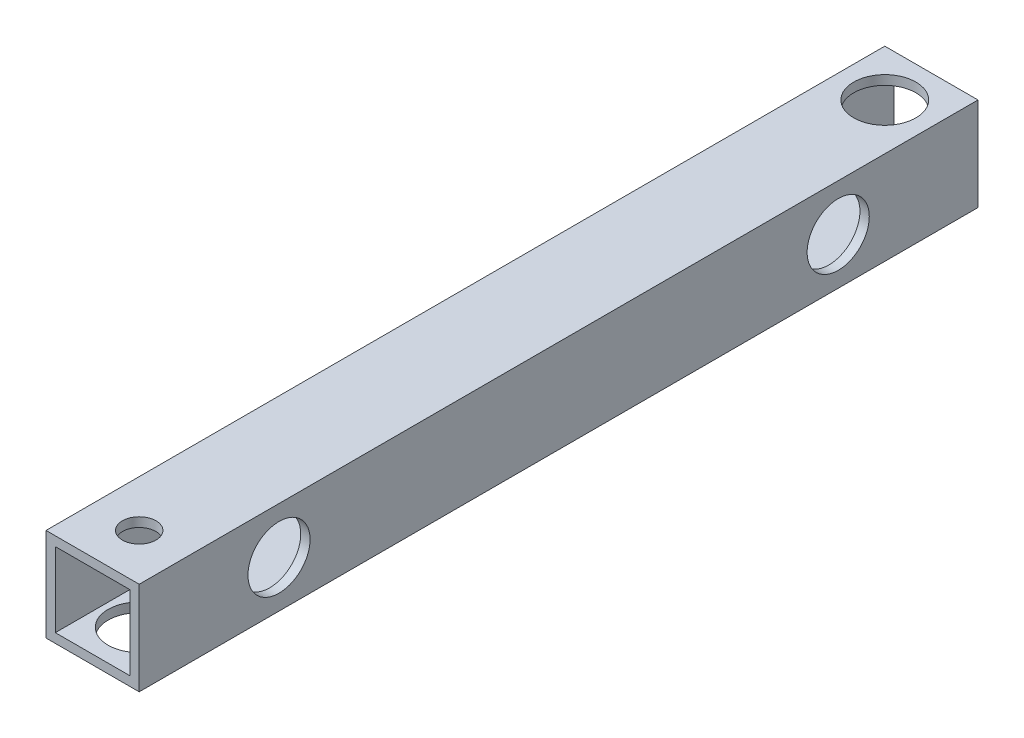
ISO-10303-21;
HEADER;
FILE_DESCRIPTION(('STEP AP214'),'2;1');
FILE_NAME('part.step','',(''),(''),'','','');
FILE_SCHEMA(('AUTOMOTIVE_DESIGN { 1 0 10303 214 1 1 1 1 }'));
ENDSEC;
DATA;
#1=APPLICATION_CONTEXT('core data for automotive mechanical design processes');
#2=APPLICATION_PROTOCOL_DEFINITION('international standard','automotive_design',2000,#1);
#3=PRODUCT_CONTEXT('',#1,'mechanical');
#4=PRODUCT('Part','Part','',(#3));
#5=PRODUCT_RELATED_PRODUCT_CATEGORY('part','',(#4));
#6=PRODUCT_DEFINITION_FORMATION('','',#4);
#7=PRODUCT_DEFINITION_CONTEXT('part definition',#1,'design');
#8=PRODUCT_DEFINITION('design','',#6,#7);
#9=PRODUCT_DEFINITION_SHAPE('','',#8);
#10=(LENGTH_UNIT() NAMED_UNIT(*) SI_UNIT(.MILLI.,.METRE.));
#11=(NAMED_UNIT(*) PLANE_ANGLE_UNIT() SI_UNIT($,.RADIAN.));
#12=(NAMED_UNIT(*) SI_UNIT($,.STERADIAN.) SOLID_ANGLE_UNIT());
#13=UNCERTAINTY_MEASURE_WITH_UNIT(LENGTH_MEASURE(1.E-05),#10,'distance_accuracy_value','');
#14=(GEOMETRIC_REPRESENTATION_CONTEXT(3) GLOBAL_UNCERTAINTY_ASSIGNED_CONTEXT((#13)) GLOBAL_UNIT_ASSIGNED_CONTEXT((#10,
#11,#12)) REPRESENTATION_CONTEXT('',''));
#15=CARTESIAN_POINT('',(0.,0.,0.));
#16=DIRECTION('',(0.,0.,1.));
#17=DIRECTION('',(1.,0.,0.));
#18=AXIS2_PLACEMENT_3D('',#15,#16,#17);
#19=CARTESIAN_POINT('',(0.,0.,135.));
#20=DIRECTION('',(0.,0.,-1.));
#21=DIRECTION('',(-1.,0.,0.));
#22=AXIS2_PLACEMENT_3D('',#19,#20,#21);
#23=PLANE('',#22);
#24=DIRECTION('',(0.,1.,0.));
#25=VECTOR('',#24,1.);
#26=CARTESIAN_POINT('',(7.5,-7.5,135.));
#27=LINE('',#26,#25);
#28=CARTESIAN_POINT('',(7.5,-7.5,135.));
#29=VERTEX_POINT('',#28);
#30=CARTESIAN_POINT('',(7.5,7.5,135.));
#31=VERTEX_POINT('',#30);
#32=EDGE_CURVE('E146',#29,#31,#27,.T.);
#33=ORIENTED_EDGE('',*,*,#32,.T.);
#34=DIRECTION('',(-1.,0.,0.));
#35=VECTOR('',#34,1.);
#36=CARTESIAN_POINT('',(-7.5,7.5,135.));
#37=LINE('',#36,#35);
#38=CARTESIAN_POINT('',(-7.5,7.5,135.));
#39=VERTEX_POINT('',#38);
#40=EDGE_CURVE('E149',#31,#39,#37,.T.);
#41=ORIENTED_EDGE('',*,*,#40,.T.);
#42=DIRECTION('',(0.,-1.,0.));
#43=VECTOR('',#42,1.);
#44=CARTESIAN_POINT('',(-7.5,-7.5,135.));
#45=LINE('',#44,#43);
#46=CARTESIAN_POINT('',(-7.5,-7.5,135.));
#47=VERTEX_POINT('',#46);
#48=EDGE_CURVE('E152',#39,#47,#45,.T.);
#49=ORIENTED_EDGE('',*,*,#48,.T.);
#50=DIRECTION('',(1.,0.,0.));
#51=VECTOR('',#50,1.);
#52=CARTESIAN_POINT('',(-7.5,-7.5,135.));
#53=LINE('',#52,#51);
#54=EDGE_CURVE('E154',#47,#29,#53,.T.);
#55=ORIENTED_EDGE('',*,*,#54,.T.);
#56=EDGE_LOOP('',(#33,#41,#49,#55));
#57=FACE_BOUND('',#56,.T.);
#58=DIRECTION('',(0.,1.,0.));
#59=VECTOR('',#58,1.);
#60=CARTESIAN_POINT('',(6.,-6.,135.));
#61=LINE('',#60,#59);
#62=CARTESIAN_POINT('',(6.,-6.,135.));
#63=VERTEX_POINT('',#62);
#64=CARTESIAN_POINT('',(6.,6.,135.));
#65=VERTEX_POINT('',#64);
#66=EDGE_CURVE('E108',#63,#65,#61,.T.);
#67=ORIENTED_EDGE('',*,*,#66,.F.);
#68=DIRECTION('',(1.,0.,0.));
#69=VECTOR('',#68,1.);
#70=CARTESIAN_POINT('',(-6.,-6.,135.));
#71=LINE('',#70,#69);
#72=CARTESIAN_POINT('',(-6.,-6.,135.));
#73=VERTEX_POINT('',#72);
#74=EDGE_CURVE('E130',#73,#63,#71,.T.);
#75=ORIENTED_EDGE('',*,*,#74,.F.);
#76=DIRECTION('',(0.,-1.,0.));
#77=VECTOR('',#76,1.);
#78=CARTESIAN_POINT('',(-6.,-6.,135.));
#79=LINE('',#78,#77);
#80=CARTESIAN_POINT('',(-6.,6.,135.));
#81=VERTEX_POINT('',#80);
#82=EDGE_CURVE('E128',#81,#73,#79,.T.);
#83=ORIENTED_EDGE('',*,*,#82,.F.);
#84=DIRECTION('',(-1.,0.,0.));
#85=VECTOR('',#84,1.);
#86=CARTESIAN_POINT('',(-6.,6.,135.));
#87=LINE('',#86,#85);
#88=EDGE_CURVE('E116',#65,#81,#87,.T.);
#89=ORIENTED_EDGE('',*,*,#88,.F.);
#90=EDGE_LOOP('',(#67,#75,#83,#89));
#91=FACE_BOUND('',#90,.T.);
#92=ADVANCED_FACE('F41',(#57,#91),#23,.F.);
#93=CARTESIAN_POINT('',(0.,0.,0.));
#94=DIRECTION('',(0.,0.,-1.));
#95=DIRECTION('',(-1.,0.,0.));
#96=AXIS2_PLACEMENT_3D('',#93,#94,#95);
#97=PLANE('',#96);
#98=DIRECTION('',(0.,1.,0.));
#99=VECTOR('',#98,1.);
#100=CARTESIAN_POINT('',(7.5,-7.5,0.));
#101=LINE('',#100,#99);
#102=CARTESIAN_POINT('',(7.5,-7.5,0.));
#103=VERTEX_POINT('',#102);
#104=CARTESIAN_POINT('',(7.5,7.5,0.));
#105=VERTEX_POINT('',#104);
#106=EDGE_CURVE('E124',#103,#105,#101,.T.);
#107=ORIENTED_EDGE('',*,*,#106,.F.);
#108=DIRECTION('',(1.,0.,0.));
#109=VECTOR('',#108,1.);
#110=CARTESIAN_POINT('',(-7.5,-7.5,0.));
#111=LINE('',#110,#109);
#112=CARTESIAN_POINT('',(-7.5,-7.5,0.));
#113=VERTEX_POINT('',#112);
#114=EDGE_CURVE('E150',#113,#103,#111,.T.);
#115=ORIENTED_EDGE('',*,*,#114,.F.);
#116=DIRECTION('',(0.,-1.,0.));
#117=VECTOR('',#116,1.);
#118=CARTESIAN_POINT('',(-7.5,-7.5,0.));
#119=LINE('',#118,#117);
#120=CARTESIAN_POINT('',(-7.5,7.5,0.));
#121=VERTEX_POINT('',#120);
#122=EDGE_CURVE('E161',#121,#113,#119,.T.);
#123=ORIENTED_EDGE('',*,*,#122,.F.);
#124=DIRECTION('',(-1.,0.,0.));
#125=VECTOR('',#124,1.);
#126=CARTESIAN_POINT('',(-7.5,7.5,0.));
#127=LINE('',#126,#125);
#128=EDGE_CURVE('E159',#105,#121,#127,.T.);
#129=ORIENTED_EDGE('',*,*,#128,.F.);
#130=EDGE_LOOP('',(#107,#115,#123,#129));
#131=FACE_BOUND('',#130,.T.);
#132=DIRECTION('',(1.,0.,0.));
#133=VECTOR('',#132,1.);
#134=CARTESIAN_POINT('',(-6.,-6.,0.));
#135=LINE('',#134,#133);
#136=CARTESIAN_POINT('',(-6.,-6.,0.));
#137=VERTEX_POINT('',#136);
#138=CARTESIAN_POINT('',(6.,-6.,0.));
#139=VERTEX_POINT('',#138);
#140=EDGE_CURVE('E117',#137,#139,#135,.T.);
#141=ORIENTED_EDGE('',*,*,#140,.T.);
#142=DIRECTION('',(0.,1.,0.));
#143=VECTOR('',#142,1.);
#144=CARTESIAN_POINT('',(6.,-6.,0.));
#145=LINE('',#144,#143);
#146=CARTESIAN_POINT('',(6.,6.,0.));
#147=VERTEX_POINT('',#146);
#148=EDGE_CURVE('E66',#139,#147,#145,.T.);
#149=ORIENTED_EDGE('',*,*,#148,.T.);
#150=DIRECTION('',(-1.,0.,0.));
#151=VECTOR('',#150,1.);
#152=CARTESIAN_POINT('',(-6.,6.,0.));
#153=LINE('',#152,#151);
#154=CARTESIAN_POINT('',(-6.,6.,0.));
#155=VERTEX_POINT('',#154);
#156=EDGE_CURVE('E123',#147,#155,#153,.T.);
#157=ORIENTED_EDGE('',*,*,#156,.T.);
#158=DIRECTION('',(0.,-1.,0.));
#159=VECTOR('',#158,1.);
#160=CARTESIAN_POINT('',(-6.,-6.,0.));
#161=LINE('',#160,#159);
#162=EDGE_CURVE('E138',#155,#137,#161,.T.);
#163=ORIENTED_EDGE('',*,*,#162,.T.);
#164=EDGE_LOOP('',(#141,#149,#157,#163));
#165=FACE_BOUND('',#164,.T.);
#166=ADVANCED_FACE('F234',(#131,#165),#97,.T.);
#167=CARTESIAN_POINT('',(7.5,-7.5,135.));
#168=DIRECTION('',(-1.,0.,0.));
#169=DIRECTION('',(0.,0.,1.));
#170=AXIS2_PLACEMENT_3D('',#167,#168,#169);
#171=PLANE('',#170);
#172=CARTESIAN_POINT('',(7.5,0.,22.5));
#173=DIRECTION('',(1.,0.,0.));
#174=DIRECTION('',(0.,0.,-1.));
#175=AXIS2_PLACEMENT_3D('',#172,#173,#174);
#176=CIRCLE('',#175,5.);
#177=CARTESIAN_POINT('',(7.5,0.,17.5));
#178=VERTEX_POINT('',#177);
#179=EDGE_CURVE('E191',#178,#178,#176,.T.);
#180=ORIENTED_EDGE('',*,*,#179,.F.);
#181=EDGE_LOOP('',(#180));
#182=FACE_BOUND('',#181,.T.);
#183=CARTESIAN_POINT('',(7.5,0.,112.5));
#184=DIRECTION('',(1.,0.,0.));
#185=DIRECTION('',(0.,0.,-1.));
#186=AXIS2_PLACEMENT_3D('',#183,#184,#185);
#187=CIRCLE('',#186,5.);
#188=CARTESIAN_POINT('',(7.5,0.,107.5));
#189=VERTEX_POINT('',#188);
#190=EDGE_CURVE('E201',#189,#189,#187,.T.);
#191=ORIENTED_EDGE('',*,*,#190,.F.);
#192=EDGE_LOOP('',(#191));
#193=FACE_BOUND('',#192,.T.);
#194=ORIENTED_EDGE('',*,*,#106,.T.);
#195=DIRECTION('',(0.,0.,-1.));
#196=VECTOR('',#195,1.);
#197=CARTESIAN_POINT('',(7.5,7.5,135.));
#198=LINE('',#197,#196);
#199=EDGE_CURVE('E11',#31,#105,#198,.T.);
#200=ORIENTED_EDGE('',*,*,#199,.F.);
#201=ORIENTED_EDGE('',*,*,#32,.F.);
#202=DIRECTION('',(0.,0.,-1.));
#203=VECTOR('',#202,1.);
#204=CARTESIAN_POINT('',(7.5,-7.5,135.));
#205=LINE('',#204,#203);
#206=EDGE_CURVE('E156',#29,#103,#205,.T.);
#207=ORIENTED_EDGE('',*,*,#206,.T.);
#208=EDGE_LOOP('',(#194,#200,#201,#207));
#209=FACE_BOUND('',#208,.T.);
#210=ADVANCED_FACE('F43',(#182,#193,#209),#171,.F.);
#211=CARTESIAN_POINT('',(-7.5,7.5,135.));
#212=DIRECTION('',(0.,-1.,0.));
#213=DIRECTION('',(0.,0.,-1.));
#214=AXIS2_PLACEMENT_3D('',#211,#212,#213);
#215=PLANE('',#214);
#216=CARTESIAN_POINT('',(0.,7.5,7.50000000000001));
#217=DIRECTION('',(0.,1.,0.));
#218=DIRECTION('',(0.,0.,1.));
#219=AXIS2_PLACEMENT_3D('',#216,#217,#218);
#220=CIRCLE('',#219,5.);
#221=CARTESIAN_POINT('',(0.,7.5,12.5));
#222=VERTEX_POINT('',#221);
#223=EDGE_CURVE('E187',#222,#222,#220,.T.);
#224=ORIENTED_EDGE('',*,*,#223,.F.);
#225=EDGE_LOOP('',(#224));
#226=FACE_BOUND('',#225,.T.);
#227=CARTESIAN_POINT('',(0.,7.5,127.5));
#228=DIRECTION('',(0.,1.,0.));
#229=DIRECTION('',(0.,0.,1.));
#230=AXIS2_PLACEMENT_3D('',#227,#228,#229);
#231=CIRCLE('',#230,2.7);
#232=CARTESIAN_POINT('',(0.,7.5,130.2));
#233=VERTEX_POINT('',#232);
#234=EDGE_CURVE('E186',#233,#233,#231,.T.);
#235=ORIENTED_EDGE('',*,*,#234,.F.);
#236=EDGE_LOOP('',(#235));
#237=FACE_BOUND('',#236,.T.);
#238=ORIENTED_EDGE('',*,*,#128,.T.);
#239=DIRECTION('',(0.,0.,-1.));
#240=VECTOR('',#239,1.);
#241=CARTESIAN_POINT('',(-7.5,7.5,135.));
#242=LINE('',#241,#240);
#243=EDGE_CURVE('E50',#39,#121,#242,.T.);
#244=ORIENTED_EDGE('',*,*,#243,.F.);
#245=ORIENTED_EDGE('',*,*,#40,.F.);
#246=ORIENTED_EDGE('',*,*,#199,.T.);
#247=EDGE_LOOP('',(#238,#244,#245,#246));
#248=FACE_BOUND('',#247,.T.);
#249=ADVANCED_FACE('F250',(#226,#237,#248),#215,.F.);
#250=CARTESIAN_POINT('',(-7.5,-7.5,135.));
#251=DIRECTION('',(1.,0.,0.));
#252=DIRECTION('',(0.,0.,-1.));
#253=AXIS2_PLACEMENT_3D('',#250,#251,#252);
#254=PLANE('',#253);
#255=CARTESIAN_POINT('',(-7.5,0.,112.5));
#256=DIRECTION('',(1.,0.,0.));
#257=DIRECTION('',(0.,0.,-1.));
#258=AXIS2_PLACEMENT_3D('',#255,#256,#257);
#259=CIRCLE('',#258,2.7);
#260=CARTESIAN_POINT('',(-7.5,0.,109.8));
#261=VERTEX_POINT('',#260);
#262=EDGE_CURVE('E136',#261,#261,#259,.T.);
#263=ORIENTED_EDGE('',*,*,#262,.T.);
#264=EDGE_LOOP('',(#263));
#265=FACE_BOUND('',#264,.T.);
#266=CARTESIAN_POINT('',(-7.5,0.,22.5));
#267=DIRECTION('',(1.,0.,0.));
#268=DIRECTION('',(0.,0.,-1.));
#269=AXIS2_PLACEMENT_3D('',#266,#267,#268);
#270=CIRCLE('',#269,2.7);
#271=CARTESIAN_POINT('',(-7.5,0.,19.8));
#272=VERTEX_POINT('',#271);
#273=EDGE_CURVE('E174',#272,#272,#270,.T.);
#274=ORIENTED_EDGE('',*,*,#273,.T.);
#275=EDGE_LOOP('',(#274));
#276=FACE_BOUND('',#275,.T.);
#277=ORIENTED_EDGE('',*,*,#122,.T.);
#278=DIRECTION('',(0.,0.,-1.));
#279=VECTOR('',#278,1.);
#280=CARTESIAN_POINT('',(-7.5,-7.5,135.));
#281=LINE('',#280,#279);
#282=EDGE_CURVE('E166',#47,#113,#281,.T.);
#283=ORIENTED_EDGE('',*,*,#282,.F.);
#284=ORIENTED_EDGE('',*,*,#48,.F.);
#285=ORIENTED_EDGE('',*,*,#243,.T.);
#286=EDGE_LOOP('',(#277,#283,#284,#285));
#287=FACE_BOUND('',#286,.T.);
#288=ADVANCED_FACE('F213',(#265,#276,#287),#254,.F.);
#289=CARTESIAN_POINT('',(-7.5,-7.5,135.));
#290=DIRECTION('',(0.,1.,0.));
#291=DIRECTION('',(0.,0.,1.));
#292=AXIS2_PLACEMENT_3D('',#289,#290,#291);
#293=PLANE('',#292);
#294=CARTESIAN_POINT('',(0.,-7.5,127.5));
#295=DIRECTION('',(0.,-1.,0.));
#296=DIRECTION('',(0.,0.,-1.));
#297=AXIS2_PLACEMENT_3D('',#294,#295,#296);
#298=CIRCLE('',#297,5.);
#299=CARTESIAN_POINT('',(0.,-7.5,122.5));
#300=VERTEX_POINT('',#299);
#301=EDGE_CURVE('E321',#300,#300,#298,.T.);
#302=ORIENTED_EDGE('',*,*,#301,.F.);
#303=EDGE_LOOP('',(#302));
#304=FACE_BOUND('',#303,.T.);
#305=CARTESIAN_POINT('',(0.,-7.5,7.50000000000001));
#306=DIRECTION('',(0.,1.,0.));
#307=DIRECTION('',(0.,0.,1.));
#308=AXIS2_PLACEMENT_3D('',#305,#306,#307);
#309=CIRCLE('',#308,2.25);
#310=CARTESIAN_POINT('',(0.,-7.5,9.75000000000001));
#311=VERTEX_POINT('',#310);
#312=EDGE_CURVE('E175',#311,#311,#309,.T.);
#313=ORIENTED_EDGE('',*,*,#312,.T.);
#314=EDGE_LOOP('',(#313));
#315=FACE_BOUND('',#314,.T.);
#316=ORIENTED_EDGE('',*,*,#114,.T.);
#317=ORIENTED_EDGE('',*,*,#206,.F.);
#318=ORIENTED_EDGE('',*,*,#54,.F.);
#319=ORIENTED_EDGE('',*,*,#282,.T.);
#320=EDGE_LOOP('',(#316,#317,#318,#319));
#321=FACE_BOUND('',#320,.T.);
#322=ADVANCED_FACE('F245',(#304,#315,#321),#293,.F.);
#323=CARTESIAN_POINT('',(6.,-6.,135.));
#324=DIRECTION('',(-1.,0.,0.));
#325=DIRECTION('',(0.,0.,1.));
#326=AXIS2_PLACEMENT_3D('',#323,#324,#325);
#327=PLANE('',#326);
#328=CARTESIAN_POINT('',(6.,0.,22.5));
#329=DIRECTION('',(-1.,0.,0.));
#330=DIRECTION('',(0.,0.,1.));
#331=AXIS2_PLACEMENT_3D('',#328,#329,#330);
#332=CIRCLE('',#331,5.);
#333=CARTESIAN_POINT('',(6.,0.,27.5));
#334=VERTEX_POINT('',#333);
#335=EDGE_CURVE('E190',#334,#334,#332,.T.);
#336=ORIENTED_EDGE('',*,*,#335,.F.);
#337=EDGE_LOOP('',(#336));
#338=FACE_BOUND('',#337,.T.);
#339=CARTESIAN_POINT('',(6.,0.,112.5));
#340=DIRECTION('',(-1.,0.,0.));
#341=DIRECTION('',(0.,0.,1.));
#342=AXIS2_PLACEMENT_3D('',#339,#340,#341);
#343=CIRCLE('',#342,5.);
#344=CARTESIAN_POINT('',(6.,0.,117.5));
#345=VERTEX_POINT('',#344);
#346=EDGE_CURVE('E188',#345,#345,#343,.T.);
#347=ORIENTED_EDGE('',*,*,#346,.F.);
#348=EDGE_LOOP('',(#347));
#349=FACE_BOUND('',#348,.T.);
#350=ORIENTED_EDGE('',*,*,#148,.F.);
#351=DIRECTION('',(0.,0.,-1.));
#352=VECTOR('',#351,1.);
#353=CARTESIAN_POINT('',(6.,-6.,135.));
#354=LINE('',#353,#352);
#355=EDGE_CURVE('E112',#63,#139,#354,.T.);
#356=ORIENTED_EDGE('',*,*,#355,.F.);
#357=ORIENTED_EDGE('',*,*,#66,.T.);
#358=DIRECTION('',(0.,0.,-1.));
#359=VECTOR('',#358,1.);
#360=CARTESIAN_POINT('',(6.,6.,135.));
#361=LINE('',#360,#359);
#362=EDGE_CURVE('E111',#65,#147,#361,.T.);
#363=ORIENTED_EDGE('',*,*,#362,.T.);
#364=EDGE_LOOP('',(#350,#356,#357,#363));
#365=FACE_BOUND('',#364,.T.);
#366=ADVANCED_FACE('F110',(#338,#349,#365),#327,.T.);
#367=CARTESIAN_POINT('',(-6.,6.,135.));
#368=DIRECTION('',(0.,-1.,0.));
#369=DIRECTION('',(0.,0.,-1.));
#370=AXIS2_PLACEMENT_3D('',#367,#368,#369);
#371=PLANE('',#370);
#372=CARTESIAN_POINT('',(0.,6.,7.50000000000001));
#373=DIRECTION('',(0.,-1.,0.));
#374=DIRECTION('',(0.,0.,-1.));
#375=AXIS2_PLACEMENT_3D('',#372,#373,#374);
#376=CIRCLE('',#375,5.);
#377=CARTESIAN_POINT('',(0.,6.,2.5));
#378=VERTEX_POINT('',#377);
#379=EDGE_CURVE('E183',#378,#378,#376,.T.);
#380=ORIENTED_EDGE('',*,*,#379,.F.);
#381=EDGE_LOOP('',(#380));
#382=FACE_BOUND('',#381,.T.);
#383=CARTESIAN_POINT('',(0.,6.,127.5));
#384=DIRECTION('',(0.,-1.,0.));
#385=DIRECTION('',(0.,0.,-1.));
#386=AXIS2_PLACEMENT_3D('',#383,#384,#385);
#387=CIRCLE('',#386,2.7);
#388=CARTESIAN_POINT('',(0.,6.,124.8));
#389=VERTEX_POINT('',#388);
#390=EDGE_CURVE('E182',#389,#389,#387,.T.);
#391=ORIENTED_EDGE('',*,*,#390,.F.);
#392=EDGE_LOOP('',(#391));
#393=FACE_BOUND('',#392,.T.);
#394=ORIENTED_EDGE('',*,*,#156,.F.);
#395=ORIENTED_EDGE('',*,*,#362,.F.);
#396=ORIENTED_EDGE('',*,*,#88,.T.);
#397=DIRECTION('',(0.,0.,-1.));
#398=VECTOR('',#397,1.);
#399=CARTESIAN_POINT('',(-6.,6.,135.));
#400=LINE('',#399,#398);
#401=EDGE_CURVE('E125',#81,#155,#400,.T.);
#402=ORIENTED_EDGE('',*,*,#401,.T.);
#403=EDGE_LOOP('',(#394,#395,#396,#402));
#404=FACE_BOUND('',#403,.T.);
#405=ADVANCED_FACE('F120',(#382,#393,#404),#371,.T.);
#406=CARTESIAN_POINT('',(-6.,-6.,135.));
#407=DIRECTION('',(1.,0.,0.));
#408=DIRECTION('',(0.,0.,-1.));
#409=AXIS2_PLACEMENT_3D('',#406,#407,#408);
#410=PLANE('',#409);
#411=CARTESIAN_POINT('',(-6.,0.,112.5));
#412=DIRECTION('',(1.,0.,0.));
#413=DIRECTION('',(0.,0.,-1.));
#414=AXIS2_PLACEMENT_3D('',#411,#412,#413);
#415=CIRCLE('',#414,2.7);
#416=CARTESIAN_POINT('',(-6.,0.,109.8));
#417=VERTEX_POINT('',#416);
#418=EDGE_CURVE('E176',#417,#417,#415,.T.);
#419=ORIENTED_EDGE('',*,*,#418,.F.);
#420=EDGE_LOOP('',(#419));
#421=FACE_BOUND('',#420,.T.);
#422=CARTESIAN_POINT('',(-6.,0.,22.5));
#423=DIRECTION('',(1.,0.,0.));
#424=DIRECTION('',(0.,0.,-1.));
#425=AXIS2_PLACEMENT_3D('',#422,#423,#424);
#426=CIRCLE('',#425,2.7);
#427=CARTESIAN_POINT('',(-6.,0.,19.8));
#428=VERTEX_POINT('',#427);
#429=EDGE_CURVE('E171',#428,#428,#426,.T.);
#430=ORIENTED_EDGE('',*,*,#429,.F.);
#431=EDGE_LOOP('',(#430));
#432=FACE_BOUND('',#431,.T.);
#433=ORIENTED_EDGE('',*,*,#162,.F.);
#434=ORIENTED_EDGE('',*,*,#401,.F.);
#435=ORIENTED_EDGE('',*,*,#82,.T.);
#436=DIRECTION('',(0.,0.,-1.));
#437=VECTOR('',#436,1.);
#438=CARTESIAN_POINT('',(-6.,-6.,135.));
#439=LINE('',#438,#437);
#440=EDGE_CURVE('E58',#73,#137,#439,.T.);
#441=ORIENTED_EDGE('',*,*,#440,.T.);
#442=EDGE_LOOP('',(#433,#434,#435,#441));
#443=FACE_BOUND('',#442,.T.);
#444=ADVANCED_FACE('F278',(#421,#432,#443),#410,.T.);
#445=CARTESIAN_POINT('',(-6.,-6.,135.));
#446=DIRECTION('',(0.,1.,0.));
#447=DIRECTION('',(0.,0.,1.));
#448=AXIS2_PLACEMENT_3D('',#445,#446,#447);
#449=PLANE('',#448);
#450=CARTESIAN_POINT('',(0.,-6.,127.5));
#451=DIRECTION('',(0.,1.,0.));
#452=DIRECTION('',(0.,0.,1.));
#453=AXIS2_PLACEMENT_3D('',#450,#451,#452);
#454=CIRCLE('',#453,5.);
#455=CARTESIAN_POINT('',(0.,-6.,132.5));
#456=VERTEX_POINT('',#455);
#457=EDGE_CURVE('E45',#456,#456,#454,.T.);
#458=ORIENTED_EDGE('',*,*,#457,.F.);
#459=EDGE_LOOP('',(#458));
#460=FACE_BOUND('',#459,.T.);
#461=CARTESIAN_POINT('',(0.,-6.,7.50000000000001));
#462=DIRECTION('',(0.,1.,0.));
#463=DIRECTION('',(0.,0.,1.));
#464=AXIS2_PLACEMENT_3D('',#461,#462,#463);
#465=CIRCLE('',#464,2.25);
#466=CARTESIAN_POINT('',(0.,-6.,9.75000000000001));
#467=VERTEX_POINT('',#466);
#468=EDGE_CURVE('E179',#467,#467,#465,.T.);
#469=ORIENTED_EDGE('',*,*,#468,.F.);
#470=EDGE_LOOP('',(#469));
#471=FACE_BOUND('',#470,.T.);
#472=ORIENTED_EDGE('',*,*,#140,.F.);
#473=ORIENTED_EDGE('',*,*,#440,.F.);
#474=ORIENTED_EDGE('',*,*,#74,.T.);
#475=ORIENTED_EDGE('',*,*,#355,.T.);
#476=EDGE_LOOP('',(#472,#473,#474,#475));
#477=FACE_BOUND('',#476,.T.);
#478=ADVANCED_FACE('F229',(#460,#471,#477),#449,.T.);
#479=CARTESIAN_POINT('',(-17.5,0.,22.5));
#480=DIRECTION('',(1.,0.,0.));
#481=DIRECTION('',(0.,0.,-1.));
#482=AXIS2_PLACEMENT_3D('',#479,#480,#481);
#483=CYLINDRICAL_SURFACE('',#482,2.7);
#484=ORIENTED_EDGE('',*,*,#429,.T.);
#485=EDGE_LOOP('',(#484));
#486=FACE_BOUND('',#485,.T.);
#487=ORIENTED_EDGE('',*,*,#273,.F.);
#488=EDGE_LOOP('',(#487));
#489=FACE_BOUND('',#488,.T.);
#490=ADVANCED_FACE('F219',(#486,#489),#483,.F.);
#491=CARTESIAN_POINT('',(-17.5,0.,112.5));
#492=DIRECTION('',(1.,0.,0.));
#493=DIRECTION('',(0.,0.,-1.));
#494=AXIS2_PLACEMENT_3D('',#491,#492,#493);
#495=CYLINDRICAL_SURFACE('',#494,2.7);
#496=ORIENTED_EDGE('',*,*,#418,.T.);
#497=EDGE_LOOP('',(#496));
#498=FACE_BOUND('',#497,.T.);
#499=ORIENTED_EDGE('',*,*,#262,.F.);
#500=EDGE_LOOP('',(#499));
#501=FACE_BOUND('',#500,.T.);
#502=ADVANCED_FACE('F216',(#498,#501),#495,.F.);
#503=CARTESIAN_POINT('',(0.,-17.5,7.50000000000001));
#504=DIRECTION('',(0.,1.,0.));
#505=DIRECTION('',(0.,0.,1.));
#506=AXIS2_PLACEMENT_3D('',#503,#504,#505);
#507=CYLINDRICAL_SURFACE('',#506,2.25);
#508=ORIENTED_EDGE('',*,*,#468,.T.);
#509=EDGE_LOOP('',(#508));
#510=FACE_BOUND('',#509,.T.);
#511=ORIENTED_EDGE('',*,*,#312,.F.);
#512=EDGE_LOOP('',(#511));
#513=FACE_BOUND('',#512,.T.);
#514=ADVANCED_FACE('F218',(#510,#513),#507,.F.);
#515=CARTESIAN_POINT('',(0.,-17.5,127.5));
#516=DIRECTION('',(0.,1.,0.));
#517=DIRECTION('',(0.,0.,1.));
#518=AXIS2_PLACEMENT_3D('',#515,#516,#517);
#519=CYLINDRICAL_SURFACE('',#518,2.7);
#520=ORIENTED_EDGE('',*,*,#390,.T.);
#521=EDGE_LOOP('',(#520));
#522=FACE_BOUND('',#521,.T.);
#523=ORIENTED_EDGE('',*,*,#234,.T.);
#524=EDGE_LOOP('',(#523));
#525=FACE_BOUND('',#524,.T.);
#526=ADVANCED_FACE('F226',(#522,#525),#519,.F.);
#527=CARTESIAN_POINT('',(0.,-2.5,7.50000000000001));
#528=DIRECTION('',(0.,1.,0.));
#529=DIRECTION('',(0.,0.,1.));
#530=AXIS2_PLACEMENT_3D('',#527,#528,#529);
#531=CYLINDRICAL_SURFACE('',#530,5.);
#532=ORIENTED_EDGE('',*,*,#379,.T.);
#533=EDGE_LOOP('',(#532));
#534=FACE_BOUND('',#533,.T.);
#535=ORIENTED_EDGE('',*,*,#223,.T.);
#536=EDGE_LOOP('',(#535));
#537=FACE_BOUND('',#536,.T.);
#538=ADVANCED_FACE('F300',(#534,#537),#531,.F.);
#539=CARTESIAN_POINT('',(-2.5,0.,112.5));
#540=DIRECTION('',(1.,0.,0.));
#541=DIRECTION('',(0.,0.,-1.));
#542=AXIS2_PLACEMENT_3D('',#539,#540,#541);
#543=CYLINDRICAL_SURFACE('',#542,5.);
#544=ORIENTED_EDGE('',*,*,#346,.T.);
#545=EDGE_LOOP('',(#544));
#546=FACE_BOUND('',#545,.T.);
#547=ORIENTED_EDGE('',*,*,#190,.T.);
#548=EDGE_LOOP('',(#547));
#549=FACE_BOUND('',#548,.T.);
#550=ADVANCED_FACE('F303',(#546,#549),#543,.F.);
#551=CARTESIAN_POINT('',(-2.5,0.,22.5));
#552=DIRECTION('',(1.,0.,0.));
#553=DIRECTION('',(0.,0.,-1.));
#554=AXIS2_PLACEMENT_3D('',#551,#552,#553);
#555=CYLINDRICAL_SURFACE('',#554,5.);
#556=ORIENTED_EDGE('',*,*,#335,.T.);
#557=EDGE_LOOP('',(#556));
#558=FACE_BOUND('',#557,.T.);
#559=ORIENTED_EDGE('',*,*,#179,.T.);
#560=EDGE_LOOP('',(#559));
#561=FACE_BOUND('',#560,.T.);
#562=ADVANCED_FACE('F309',(#558,#561),#555,.F.);
#563=CARTESIAN_POINT('',(0.,2.5,127.5));
#564=DIRECTION('',(0.,-1.,0.));
#565=DIRECTION('',(0.,0.,-1.));
#566=AXIS2_PLACEMENT_3D('',#563,#564,#565);
#567=CYLINDRICAL_SURFACE('',#566,5.);
#568=ORIENTED_EDGE('',*,*,#457,.T.);
#569=EDGE_LOOP('',(#568));
#570=FACE_BOUND('',#569,.T.);
#571=ORIENTED_EDGE('',*,*,#301,.T.);
#572=EDGE_LOOP('',(#571));
#573=FACE_BOUND('',#572,.T.);
#574=ADVANCED_FACE('F313',(#570,#573),#567,.F.);
#575=CLOSED_SHELL('',(#92,#166,#210,#249,#288,#322,#366,#405,#444,#478,#490,#502,#514,#526,#538,
#550,#562,#574));
#576=MANIFOLD_SOLID_BREP('B2',#575);
#577=ADVANCED_BREP_SHAPE_REPRESENTATION('',(#18,#576),#14);
#578=SHAPE_DEFINITION_REPRESENTATION(#9,#577);
ENDSEC;
END-ISO-10303-21;
